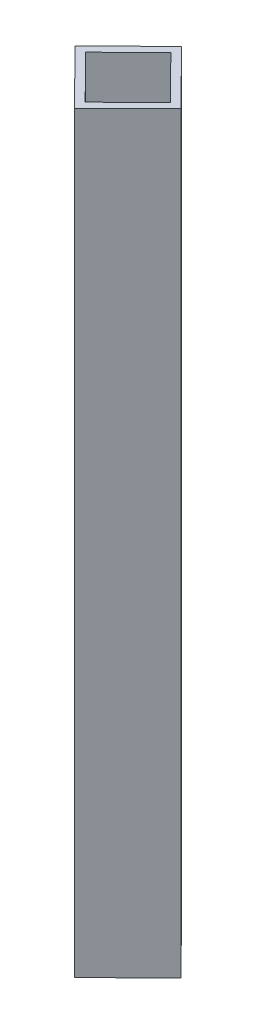
ISO-10303-21;
HEADER;
FILE_DESCRIPTION(('STEP AP214'),'2;1');
FILE_NAME('part.step','',(''),(''),'','','');
FILE_SCHEMA(('AUTOMOTIVE_DESIGN { 1 0 10303 214 1 1 1 1 }'));
ENDSEC;
DATA;
#1=APPLICATION_CONTEXT('core data for automotive mechanical design processes');
#2=APPLICATION_PROTOCOL_DEFINITION('international standard','automotive_design',2000,#1);
#3=PRODUCT_CONTEXT('',#1,'mechanical');
#4=PRODUCT('Part','Part','',(#3));
#5=PRODUCT_RELATED_PRODUCT_CATEGORY('part','',(#4));
#6=PRODUCT_DEFINITION_FORMATION('','',#4);
#7=PRODUCT_DEFINITION_CONTEXT('part definition',#1,'design');
#8=PRODUCT_DEFINITION('design','',#6,#7);
#9=PRODUCT_DEFINITION_SHAPE('','',#8);
#10=(LENGTH_UNIT() NAMED_UNIT(*) SI_UNIT(.MILLI.,.METRE.));
#11=(NAMED_UNIT(*) PLANE_ANGLE_UNIT() SI_UNIT($,.RADIAN.));
#12=(NAMED_UNIT(*) SI_UNIT($,.STERADIAN.) SOLID_ANGLE_UNIT());
#13=UNCERTAINTY_MEASURE_WITH_UNIT(LENGTH_MEASURE(1.E-05),#10,'distance_accuracy_value','');
#14=(GEOMETRIC_REPRESENTATION_CONTEXT(3) GLOBAL_UNCERTAINTY_ASSIGNED_CONTEXT((#13)) GLOBAL_UNIT_ASSIGNED_CONTEXT((#10,
#11,#12)) REPRESENTATION_CONTEXT('',''));
#15=CARTESIAN_POINT('',(0.,0.,0.));
#16=DIRECTION('',(0.,0.,1.));
#17=DIRECTION('',(1.,0.,0.));
#18=AXIS2_PLACEMENT_3D('',#15,#16,#17);
#19=CARTESIAN_POINT('',(0.,1000.,0.));
#20=DIRECTION('',(0.,1.,0.));
#21=DIRECTION('',(0.,0.,1.));
#22=AXIS2_PLACEMENT_3D('',#19,#20,#21);
#23=PLANE('',#22);
#24=DIRECTION('',(-0.711770758980996,0.,0.702411835506505));
#25=VECTOR('',#24,1.);
#26=CARTESIAN_POINT('',(0.,1000.,-71.1833108050426));
#27=LINE('',#26,#25);
#28=CARTESIAN_POINT('',(0.,1000.,-71.1833108050426));
#29=VERTEX_POINT('',#28);
#30=CARTESIAN_POINT('',(-71.1770758980996,1000.,-0.942127254392107));
#31=VERTEX_POINT('',#30);
#32=EDGE_CURVE('E158',#29,#31,#27,.T.);
#33=ORIENTED_EDGE('',*,*,#32,.T.);
#34=DIRECTION('',(0.702411835506505,0.,0.711770758980996));
#35=VECTOR('',#34,1.);
#36=CARTESIAN_POINT('',(-71.1770758980996,1000.,-0.942127254392107));
#37=LINE('',#36,#35);
#38=CARTESIAN_POINT('',(0.,1000.,71.1833108050426));
#39=VERTEX_POINT('',#38);
#40=EDGE_CURVE('E161',#31,#39,#37,.T.);
#41=ORIENTED_EDGE('',*,*,#40,.T.);
#42=DIRECTION('',(0.711770758980996,0.,-0.702411835506505));
#43=VECTOR('',#42,1.);
#44=CARTESIAN_POINT('',(71.1770758980996,1000.,0.942127254392102));
#45=LINE('',#44,#43);
#46=CARTESIAN_POINT('',(71.1770758980996,1000.,0.942127254392102));
#47=VERTEX_POINT('',#46);
#48=EDGE_CURVE('E164',#39,#47,#45,.T.);
#49=ORIENTED_EDGE('',*,*,#48,.T.);
#50=DIRECTION('',(-0.702411835506505,0.,-0.711770758980996));
#51=VECTOR('',#50,1.);
#52=CARTESIAN_POINT('',(0.,1000.,-71.1833108050426));
#53=LINE('',#52,#51);
#54=EDGE_CURVE('E166',#47,#29,#53,.T.);
#55=ORIENTED_EDGE('',*,*,#54,.T.);
#56=EDGE_LOOP('',(#33,#41,#49,#55));
#57=FACE_BOUND('',#56,.T.);
#58=DIRECTION('',(0.702411835506505,0.,0.711770758980996));
#59=VECTOR('',#58,1.);
#60=CARTESIAN_POINT('',(-64.0593683082896,1000.,-7.96624560945715));
#61=LINE('',#60,#59);
#62=CARTESIAN_POINT('',(-57.0352499532246,1000.,-0.848538019647192));
#63=VERTEX_POINT('',#62);
#64=CARTESIAN_POINT('',(0.0935892347448843,1000.,57.0414848601676));
#65=VERTEX_POINT('',#64);
#66=EDGE_CURVE('E130',#63,#65,#61,.T.);
#67=ORIENTED_EDGE('',*,*,#66,.F.);
#68=DIRECTION('',(-0.711770758980996,0.,0.702411835506505));
#69=VECTOR('',#68,1.);
#70=CARTESIAN_POINT('',(7.02411835506506,1000.,-64.0656032152327));
#71=LINE('',#70,#69);
#72=CARTESIAN_POINT('',(-0.0935892347448918,1000.,-57.0414848601676));
#73=VERTEX_POINT('',#72);
#74=EDGE_CURVE('E122',#73,#63,#71,.T.);
#75=ORIENTED_EDGE('',*,*,#74,.F.);
#76=DIRECTION('',(-0.702411835506505,0.,-0.711770758980996));
#77=VECTOR('',#76,1.);
#78=CARTESIAN_POINT('',(-7.11770758980994,1000.,-64.1591924499776));
#79=LINE('',#78,#77);
#80=CARTESIAN_POINT('',(57.0352499532246,1000.,0.848538019647183));
#81=VERTEX_POINT('',#80);
#82=EDGE_CURVE('E144',#81,#73,#79,.T.);
#83=ORIENTED_EDGE('',*,*,#82,.F.);
#84=DIRECTION('',(0.711770758980996,0.,-0.702411835506505));
#85=VECTOR('',#84,1.);
#86=CARTESIAN_POINT('',(64.1529575430345,1000.,-6.17558033541786));
#87=LINE('',#86,#85);
#88=EDGE_CURVE('E142',#65,#81,#87,.T.);
#89=ORIENTED_EDGE('',*,*,#88,.F.);
#90=EDGE_LOOP('',(#67,#75,#83,#89));
#91=FACE_BOUND('',#90,.T.);
#92=ADVANCED_FACE('F57',(#57,#91),#23,.T.);
#93=CARTESIAN_POINT('',(0.,0.,0.));
#94=DIRECTION('',(0.,1.,0.));
#95=DIRECTION('',(0.,0.,1.));
#96=AXIS2_PLACEMENT_3D('',#93,#94,#95);
#97=PLANE('',#96);
#98=DIRECTION('',(-0.711770758980996,0.,0.702411835506505));
#99=VECTOR('',#98,1.);
#100=CARTESIAN_POINT('',(0.,0.,-71.1833108050426));
#101=LINE('',#100,#99);
#102=CARTESIAN_POINT('',(0.,0.,-71.1833108050426));
#103=VERTEX_POINT('',#102);
#104=CARTESIAN_POINT('',(-71.1770758980996,0.,-0.942127254392107));
#105=VERTEX_POINT('',#104);
#106=EDGE_CURVE('E138',#103,#105,#101,.T.);
#107=ORIENTED_EDGE('',*,*,#106,.F.);
#108=DIRECTION('',(-0.702411835506505,0.,-0.711770758980996));
#109=VECTOR('',#108,1.);
#110=CARTESIAN_POINT('',(0.,0.,-71.1833108050426));
#111=LINE('',#110,#109);
#112=CARTESIAN_POINT('',(71.1770758980996,0.,0.942127254392102));
#113=VERTEX_POINT('',#112);
#114=EDGE_CURVE('E162',#113,#103,#111,.T.);
#115=ORIENTED_EDGE('',*,*,#114,.F.);
#116=DIRECTION('',(0.711770758980996,0.,-0.702411835506505));
#117=VECTOR('',#116,1.);
#118=CARTESIAN_POINT('',(71.1770758980996,0.,0.942127254392102));
#119=LINE('',#118,#117);
#120=CARTESIAN_POINT('',(0.,0.,71.1833108050426));
#121=VERTEX_POINT('',#120);
#122=EDGE_CURVE('E173',#121,#113,#119,.T.);
#123=ORIENTED_EDGE('',*,*,#122,.F.);
#124=DIRECTION('',(0.702411835506505,0.,0.711770758980996));
#125=VECTOR('',#124,1.);
#126=CARTESIAN_POINT('',(-71.1770758980996,0.,-0.942127254392107));
#127=LINE('',#126,#125);
#128=EDGE_CURVE('E171',#105,#121,#127,.T.);
#129=ORIENTED_EDGE('',*,*,#128,.F.);
#130=EDGE_LOOP('',(#107,#115,#123,#129));
#131=FACE_BOUND('',#130,.T.);
#132=DIRECTION('',(-0.711770758980996,0.,0.702411835506505));
#133=VECTOR('',#132,1.);
#134=CARTESIAN_POINT('',(7.02411835506506,0.,-64.0656032152327));
#135=LINE('',#134,#133);
#136=CARTESIAN_POINT('',(-0.0935892347448779,0.,-57.0414848601676));
#137=VERTEX_POINT('',#136);
#138=CARTESIAN_POINT('',(-57.0352499532246,0.,-0.848538019647192));
#139=VERTEX_POINT('',#138);
#140=EDGE_CURVE('E80',#137,#139,#135,.T.);
#141=ORIENTED_EDGE('',*,*,#140,.T.);
#142=DIRECTION('',(0.702411835506505,0.,0.711770758980996));
#143=VECTOR('',#142,1.);
#144=CARTESIAN_POINT('',(-64.0593683082896,0.,-7.96624560945715));
#145=LINE('',#144,#143);
#146=CARTESIAN_POINT('',(0.0935892347448843,0.,57.0414848601676));
#147=VERTEX_POINT('',#146);
#148=EDGE_CURVE('E137',#139,#147,#145,.T.);
#149=ORIENTED_EDGE('',*,*,#148,.T.);
#150=DIRECTION('',(0.711770758980996,0.,-0.702411835506505));
#151=VECTOR('',#150,1.);
#152=CARTESIAN_POINT('',(64.1529575430345,0.,-6.17558033541786));
#153=LINE('',#152,#151);
#154=CARTESIAN_POINT('',(57.0352499532246,0.,0.848538019647183));
#155=VERTEX_POINT('',#154);
#156=EDGE_CURVE('E150',#147,#155,#153,.T.);
#157=ORIENTED_EDGE('',*,*,#156,.T.);
#158=DIRECTION('',(-0.702411835506505,0.,-0.711770758980996));
#159=VECTOR('',#158,1.);
#160=CARTESIAN_POINT('',(-7.11770758980994,0.,-64.1591924499776));
#161=LINE('',#160,#159);
#162=EDGE_CURVE('E131',#155,#137,#161,.T.);
#163=ORIENTED_EDGE('',*,*,#162,.T.);
#164=EDGE_LOOP('',(#141,#149,#157,#163));
#165=FACE_BOUND('',#164,.T.);
#166=ADVANCED_FACE('F191',(#131,#165),#97,.F.);
#167=CARTESIAN_POINT('',(0.,1000.,-71.1833108050426));
#168=DIRECTION('',(0.702411835506505,0.,0.711770758980996));
#169=DIRECTION('',(0.711770758980996,0.,-0.702411835506505));
#170=AXIS2_PLACEMENT_3D('',#167,#168,#169);
#171=PLANE('',#170);
#172=ORIENTED_EDGE('',*,*,#106,.T.);
#173=DIRECTION('',(0.,-1.,0.));
#174=VECTOR('',#173,1.);
#175=CARTESIAN_POINT('',(-71.1770758980996,1000.,-0.942127254392107));
#176=LINE('',#175,#174);
#177=EDGE_CURVE('E12',#31,#105,#176,.T.);
#178=ORIENTED_EDGE('',*,*,#177,.F.);
#179=ORIENTED_EDGE('',*,*,#32,.F.);
#180=DIRECTION('',(0.,-1.,0.));
#181=VECTOR('',#180,1.);
#182=CARTESIAN_POINT('',(0.,1000.,-71.1833108050426));
#183=LINE('',#182,#181);
#184=EDGE_CURVE('E168',#29,#103,#183,.T.);
#185=ORIENTED_EDGE('',*,*,#184,.T.);
#186=EDGE_LOOP('',(#172,#178,#179,#185));
#187=FACE_BOUND('',#186,.T.);
#188=ADVANCED_FACE('F59',(#187),#171,.F.);
#189=CARTESIAN_POINT('',(-71.1770758980996,1000.,-0.942127254392107));
#190=DIRECTION('',(0.711770758980996,0.,-0.702411835506505));
#191=DIRECTION('',(-0.702411835506505,0.,-0.711770758980996));
#192=AXIS2_PLACEMENT_3D('',#189,#190,#191);
#193=PLANE('',#192);
#194=ORIENTED_EDGE('',*,*,#128,.T.);
#195=DIRECTION('',(0.,-1.,0.));
#196=VECTOR('',#195,1.);
#197=CARTESIAN_POINT('',(0.,1000.,71.1833108050426));
#198=LINE('',#197,#196);
#199=EDGE_CURVE('E65',#39,#121,#198,.T.);
#200=ORIENTED_EDGE('',*,*,#199,.F.);
#201=ORIENTED_EDGE('',*,*,#40,.F.);
#202=ORIENTED_EDGE('',*,*,#177,.T.);
#203=EDGE_LOOP('',(#194,#200,#201,#202));
#204=FACE_BOUND('',#203,.T.);
#205=ADVANCED_FACE('F201',(#204),#193,.F.);
#206=CARTESIAN_POINT('',(71.1770758980996,1000.,0.942127254392102));
#207=DIRECTION('',(-0.702411835506505,0.,-0.711770758980996));
#208=DIRECTION('',(-0.711770758980996,0.,0.702411835506505));
#209=AXIS2_PLACEMENT_3D('',#206,#207,#208);
#210=PLANE('',#209);
#211=ORIENTED_EDGE('',*,*,#122,.T.);
#212=DIRECTION('',(0.,-1.,0.));
#213=VECTOR('',#212,1.);
#214=CARTESIAN_POINT('',(71.1770758980996,1000.,0.942127254392102));
#215=LINE('',#214,#213);
#216=EDGE_CURVE('E178',#47,#113,#215,.T.);
#217=ORIENTED_EDGE('',*,*,#216,.F.);
#218=ORIENTED_EDGE('',*,*,#48,.F.);
#219=ORIENTED_EDGE('',*,*,#199,.T.);
#220=EDGE_LOOP('',(#211,#217,#218,#219));
#221=FACE_BOUND('',#220,.T.);
#222=ADVANCED_FACE('F185',(#221),#210,.F.);
#223=CARTESIAN_POINT('',(0.,1000.,-71.1833108050426));
#224=DIRECTION('',(-0.711770758980996,0.,0.702411835506505));
#225=DIRECTION('',(0.702411835506505,0.,0.711770758980996));
#226=AXIS2_PLACEMENT_3D('',#223,#224,#225);
#227=PLANE('',#226);
#228=ORIENTED_EDGE('',*,*,#114,.T.);
#229=ORIENTED_EDGE('',*,*,#184,.F.);
#230=ORIENTED_EDGE('',*,*,#54,.F.);
#231=ORIENTED_EDGE('',*,*,#216,.T.);
#232=EDGE_LOOP('',(#228,#229,#230,#231));
#233=FACE_BOUND('',#232,.T.);
#234=ADVANCED_FACE('F195',(#233),#227,.F.);
#235=CARTESIAN_POINT('',(7.02411835506506,1000.,-64.0656032152327));
#236=DIRECTION('',(0.702411835506505,0.,0.711770758980996));
#237=DIRECTION('',(0.711770758980996,0.,-0.702411835506505));
#238=AXIS2_PLACEMENT_3D('',#235,#236,#237);
#239=PLANE('',#238);
#240=ORIENTED_EDGE('',*,*,#140,.F.);
#241=DIRECTION('',(0.,-1.,0.));
#242=VECTOR('',#241,1.);
#243=CARTESIAN_POINT('',(-0.0935892347448918,1000.,-57.0414848601676));
#244=LINE('',#243,#242);
#245=EDGE_CURVE('E126',#73,#137,#244,.T.);
#246=ORIENTED_EDGE('',*,*,#245,.F.);
#247=ORIENTED_EDGE('',*,*,#74,.T.);
#248=DIRECTION('',(0.,-1.,0.));
#249=VECTOR('',#248,1.);
#250=CARTESIAN_POINT('',(-57.0352499532246,1000.,-0.848538019647192));
#251=LINE('',#250,#249);
#252=EDGE_CURVE('E125',#63,#139,#251,.T.);
#253=ORIENTED_EDGE('',*,*,#252,.T.);
#254=EDGE_LOOP('',(#240,#246,#247,#253));
#255=FACE_BOUND('',#254,.T.);
#256=ADVANCED_FACE('F124',(#255),#239,.T.);
#257=CARTESIAN_POINT('',(-64.0593683082896,1000.,-7.96624560945715));
#258=DIRECTION('',(0.711770758980996,0.,-0.702411835506505));
#259=DIRECTION('',(-0.702411835506505,0.,-0.711770758980996));
#260=AXIS2_PLACEMENT_3D('',#257,#258,#259);
#261=PLANE('',#260);
#262=ORIENTED_EDGE('',*,*,#148,.F.);
#263=ORIENTED_EDGE('',*,*,#252,.F.);
#264=ORIENTED_EDGE('',*,*,#66,.T.);
#265=DIRECTION('',(0.,-1.,0.));
#266=VECTOR('',#265,1.);
#267=CARTESIAN_POINT('',(0.0935892347448843,1000.,57.0414848601676));
#268=LINE('',#267,#266);
#269=EDGE_CURVE('E139',#65,#147,#268,.T.);
#270=ORIENTED_EDGE('',*,*,#269,.T.);
#271=EDGE_LOOP('',(#262,#263,#264,#270));
#272=FACE_BOUND('',#271,.T.);
#273=ADVANCED_FACE('F134',(#272),#261,.T.);
#274=CARTESIAN_POINT('',(64.1529575430345,1000.,-6.17558033541786));
#275=DIRECTION('',(-0.702411835506505,0.,-0.711770758980996));
#276=DIRECTION('',(-0.711770758980996,0.,0.702411835506505));
#277=AXIS2_PLACEMENT_3D('',#274,#275,#276);
#278=PLANE('',#277);
#279=ORIENTED_EDGE('',*,*,#156,.F.);
#280=ORIENTED_EDGE('',*,*,#269,.F.);
#281=ORIENTED_EDGE('',*,*,#88,.T.);
#282=DIRECTION('',(0.,-1.,0.));
#283=VECTOR('',#282,1.);
#284=CARTESIAN_POINT('',(57.0352499532246,1000.,0.848538019647183));
#285=LINE('',#284,#283);
#286=EDGE_CURVE('E72',#81,#155,#285,.T.);
#287=ORIENTED_EDGE('',*,*,#286,.T.);
#288=EDGE_LOOP('',(#279,#280,#281,#287));
#289=FACE_BOUND('',#288,.T.);
#290=ADVANCED_FACE('F224',(#289),#278,.T.);
#291=CARTESIAN_POINT('',(-7.11770758980994,1000.,-64.1591924499776));
#292=DIRECTION('',(-0.711770758980996,0.,0.702411835506505));
#293=DIRECTION('',(0.702411835506505,0.,0.711770758980996));
#294=AXIS2_PLACEMENT_3D('',#291,#292,#293);
#295=PLANE('',#294);
#296=ORIENTED_EDGE('',*,*,#162,.F.);
#297=ORIENTED_EDGE('',*,*,#286,.F.);
#298=ORIENTED_EDGE('',*,*,#82,.T.);
#299=ORIENTED_EDGE('',*,*,#245,.T.);
#300=EDGE_LOOP('',(#296,#297,#298,#299));
#301=FACE_BOUND('',#300,.T.);
#302=ADVANCED_FACE('F228',(#301),#295,.T.);
#303=CLOSED_SHELL('',(#92,#166,#188,#205,#222,#234,#256,#273,#290,#302));
#304=MANIFOLD_SOLID_BREP('B2',#303);
#305=ADVANCED_BREP_SHAPE_REPRESENTATION('',(#18,#304),#14);
#306=SHAPE_DEFINITION_REPRESENTATION(#9,#305);
ENDSEC;
END-ISO-10303-21;
